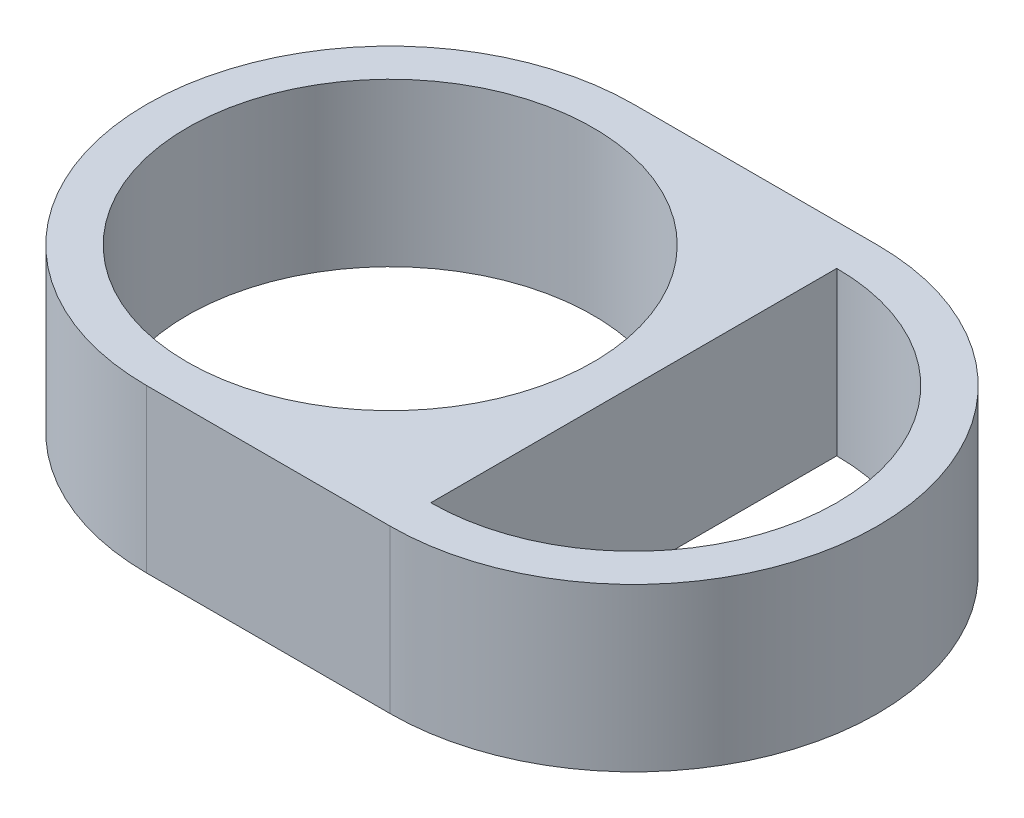
ISO-10303-21;
HEADER;
FILE_DESCRIPTION(('STEP AP214'),'2;1');
FILE_NAME('part.step','',(''),(''),'','','');
FILE_SCHEMA(('AUTOMOTIVE_DESIGN { 1 0 10303 214 1 1 1 1 }'));
ENDSEC;
DATA;
#1=APPLICATION_CONTEXT('core data for automotive mechanical design processes');
#2=APPLICATION_PROTOCOL_DEFINITION('international standard','automotive_design',2000,#1);
#3=PRODUCT_CONTEXT('',#1,'mechanical');
#4=PRODUCT('Part','Part','',(#3));
#5=PRODUCT_RELATED_PRODUCT_CATEGORY('part','',(#4));
#6=PRODUCT_DEFINITION_FORMATION('','',#4);
#7=PRODUCT_DEFINITION_CONTEXT('part definition',#1,'design');
#8=PRODUCT_DEFINITION('design','',#6,#7);
#9=PRODUCT_DEFINITION_SHAPE('','',#8);
#10=(LENGTH_UNIT() NAMED_UNIT(*) SI_UNIT(.MILLI.,.METRE.));
#11=(NAMED_UNIT(*) PLANE_ANGLE_UNIT() SI_UNIT($,.RADIAN.));
#12=(NAMED_UNIT(*) SI_UNIT($,.STERADIAN.) SOLID_ANGLE_UNIT());
#13=UNCERTAINTY_MEASURE_WITH_UNIT(LENGTH_MEASURE(1.E-05),#10,'distance_accuracy_value','');
#14=(GEOMETRIC_REPRESENTATION_CONTEXT(3) GLOBAL_UNCERTAINTY_ASSIGNED_CONTEXT((#13)) GLOBAL_UNIT_ASSIGNED_CONTEXT((#10,
#11,#12)) REPRESENTATION_CONTEXT('',''));
#15=CARTESIAN_POINT('',(0.,0.,0.));
#16=DIRECTION('',(0.,0.,1.));
#17=DIRECTION('',(1.,0.,0.));
#18=AXIS2_PLACEMENT_3D('',#15,#16,#17);
#19=CARTESIAN_POINT('',(12.,8.,0.));
#20=DIRECTION('',(0.,-1.,0.));
#21=DIRECTION('',(0.,0.,-1.));
#22=AXIS2_PLACEMENT_3D('',#19,#20,#21);
#23=PLANE('',#22);
#24=CARTESIAN_POINT('',(0.,8.,0.));
#25=DIRECTION('',(0.,1.,0.));
#26=DIRECTION('',(0.,0.,1.));
#27=AXIS2_PLACEMENT_3D('',#24,#25,#26);
#28=CIRCLE('',#27,10.);
#29=CARTESIAN_POINT('',(0.,8.,10.));
#30=VERTEX_POINT('',#29);
#31=EDGE_CURVE('E138',#30,#30,#28,.T.);
#32=ORIENTED_EDGE('',*,*,#31,.F.);
#33=EDGE_LOOP('',(#32));
#34=FACE_BOUND('',#33,.T.);
#35=CARTESIAN_POINT('',(12.,8.,0.));
#36=DIRECTION('',(0.,-1.,0.));
#37=DIRECTION('',(0.,0.,-1.));
#38=AXIS2_PLACEMENT_3D('',#35,#36,#37);
#39=CIRCLE('',#38,12.);
#40=CARTESIAN_POINT('',(12.,8.,-12.));
#41=VERTEX_POINT('',#40);
#42=CARTESIAN_POINT('',(12.,8.,12.));
#43=VERTEX_POINT('',#42);
#44=EDGE_CURVE('E144',#41,#43,#39,.T.);
#45=ORIENTED_EDGE('',*,*,#44,.F.);
#46=DIRECTION('',(-1.,0.,0.));
#47=VECTOR('',#46,1.);
#48=CARTESIAN_POINT('',(12.,8.,-12.));
#49=LINE('',#48,#47);
#50=CARTESIAN_POINT('',(0.,8.,-12.));
#51=VERTEX_POINT('',#50);
#52=EDGE_CURVE('E152',#41,#51,#49,.T.);
#53=ORIENTED_EDGE('',*,*,#52,.T.);
#54=CARTESIAN_POINT('',(0.,8.,0.));
#55=DIRECTION('',(0.,1.,0.));
#56=DIRECTION('',(0.,0.,1.));
#57=AXIS2_PLACEMENT_3D('',#54,#55,#56);
#58=CIRCLE('',#57,12.);
#59=CARTESIAN_POINT('',(0.,8.,12.));
#60=VERTEX_POINT('',#59);
#61=EDGE_CURVE('E150',#51,#60,#58,.T.);
#62=ORIENTED_EDGE('',*,*,#61,.T.);
#63=DIRECTION('',(1.,0.,0.));
#64=VECTOR('',#63,1.);
#65=CARTESIAN_POINT('',(0.,8.,12.));
#66=LINE('',#65,#64);
#67=EDGE_CURVE('E147',#60,#43,#66,.T.);
#68=ORIENTED_EDGE('',*,*,#67,.T.);
#69=EDGE_LOOP('',(#45,#53,#62,#68));
#70=FACE_BOUND('',#69,.T.);
#71=DIRECTION('',(0.,0.,1.));
#72=VECTOR('',#71,1.);
#73=CARTESIAN_POINT('',(12.,8.,-10.));
#74=LINE('',#73,#72);
#75=CARTESIAN_POINT('',(12.,8.,-10.));
#76=VERTEX_POINT('',#75);
#77=CARTESIAN_POINT('',(12.,8.,10.));
#78=VERTEX_POINT('',#77);
#79=EDGE_CURVE('E123',#76,#78,#74,.T.);
#80=ORIENTED_EDGE('',*,*,#79,.F.);
#81=CARTESIAN_POINT('',(12.,8.,0.));
#82=DIRECTION('',(0.,-1.,0.));
#83=DIRECTION('',(0.,0.,-1.));
#84=AXIS2_PLACEMENT_3D('',#81,#82,#83);
#85=CIRCLE('',#84,10.);
#86=EDGE_CURVE('E126',#76,#78,#85,.T.);
#87=ORIENTED_EDGE('',*,*,#86,.T.);
#88=EDGE_LOOP('',(#80,#87));
#89=FACE_BOUND('',#88,.T.);
#90=ADVANCED_FACE('F68',(#34,#70,#89),#23,.F.);
#91=CARTESIAN_POINT('',(12.,0.,0.));
#92=DIRECTION('',(0.,-1.,0.));
#93=DIRECTION('',(0.,0.,-1.));
#94=AXIS2_PLACEMENT_3D('',#91,#92,#93);
#95=PLANE('',#94);
#96=CARTESIAN_POINT('',(12.,0.,0.));
#97=DIRECTION('',(0.,-1.,0.));
#98=DIRECTION('',(0.,0.,-1.));
#99=AXIS2_PLACEMENT_3D('',#96,#97,#98);
#100=CIRCLE('',#99,12.);
#101=CARTESIAN_POINT('',(12.,0.,-12.));
#102=VERTEX_POINT('',#101);
#103=CARTESIAN_POINT('',(12.,0.,12.));
#104=VERTEX_POINT('',#103);
#105=EDGE_CURVE('E141',#102,#104,#100,.T.);
#106=ORIENTED_EDGE('',*,*,#105,.T.);
#107=DIRECTION('',(1.,0.,0.));
#108=VECTOR('',#107,1.);
#109=CARTESIAN_POINT('',(0.,0.,12.));
#110=LINE('',#109,#108);
#111=CARTESIAN_POINT('',(0.,0.,12.));
#112=VERTEX_POINT('',#111);
#113=EDGE_CURVE('E156',#112,#104,#110,.T.);
#114=ORIENTED_EDGE('',*,*,#113,.F.);
#115=CARTESIAN_POINT('',(0.,0.,0.));
#116=DIRECTION('',(0.,1.,0.));
#117=DIRECTION('',(0.,0.,1.));
#118=AXIS2_PLACEMENT_3D('',#115,#116,#117);
#119=CIRCLE('',#118,12.);
#120=CARTESIAN_POINT('',(0.,0.,-12.));
#121=VERTEX_POINT('',#120);
#122=EDGE_CURVE('E159',#121,#112,#119,.T.);
#123=ORIENTED_EDGE('',*,*,#122,.F.);
#124=DIRECTION('',(-1.,0.,0.));
#125=VECTOR('',#124,1.);
#126=CARTESIAN_POINT('',(12.,0.,-12.));
#127=LINE('',#126,#125);
#128=EDGE_CURVE('E148',#102,#121,#127,.T.);
#129=ORIENTED_EDGE('',*,*,#128,.F.);
#130=EDGE_LOOP('',(#106,#114,#123,#129));
#131=FACE_BOUND('',#130,.T.);
#132=CARTESIAN_POINT('',(0.,0.,0.));
#133=DIRECTION('',(0.,1.,0.));
#134=DIRECTION('',(0.,0.,1.));
#135=AXIS2_PLACEMENT_3D('',#132,#133,#134);
#136=CIRCLE('',#135,10.);
#137=CARTESIAN_POINT('',(0.,0.,10.));
#138=VERTEX_POINT('',#137);
#139=EDGE_CURVE('E137',#138,#138,#136,.T.);
#140=ORIENTED_EDGE('',*,*,#139,.T.);
#141=EDGE_LOOP('',(#140));
#142=FACE_BOUND('',#141,.T.);
#143=CARTESIAN_POINT('',(12.,0.,0.));
#144=DIRECTION('',(0.,-1.,0.));
#145=DIRECTION('',(0.,0.,-1.));
#146=AXIS2_PLACEMENT_3D('',#143,#144,#145);
#147=CIRCLE('',#146,10.);
#148=CARTESIAN_POINT('',(12.,0.,-10.));
#149=VERTEX_POINT('',#148);
#150=CARTESIAN_POINT('',(12.,0.,10.));
#151=VERTEX_POINT('',#150);
#152=EDGE_CURVE('E131',#149,#151,#147,.T.);
#153=ORIENTED_EDGE('',*,*,#152,.F.);
#154=DIRECTION('',(0.,0.,1.));
#155=VECTOR('',#154,1.);
#156=CARTESIAN_POINT('',(12.,0.,-10.));
#157=LINE('',#156,#155);
#158=EDGE_CURVE('E92',#149,#151,#157,.T.);
#159=ORIENTED_EDGE('',*,*,#158,.T.);
#160=EDGE_LOOP('',(#153,#159));
#161=FACE_BOUND('',#160,.T.);
#162=ADVANCED_FACE('F177',(#131,#142,#161),#95,.T.);
#163=CARTESIAN_POINT('',(12.,8.,0.));
#164=DIRECTION('',(0.,-1.,0.));
#165=DIRECTION('',(0.,0.,-1.));
#166=AXIS2_PLACEMENT_3D('',#163,#164,#165);
#167=CYLINDRICAL_SURFACE('',#166,12.);
#168=ORIENTED_EDGE('',*,*,#105,.F.);
#169=DIRECTION('',(0.,-1.,0.));
#170=VECTOR('',#169,1.);
#171=CARTESIAN_POINT('',(12.,8.,-12.));
#172=LINE('',#171,#170);
#173=EDGE_CURVE('E12',#41,#102,#172,.T.);
#174=ORIENTED_EDGE('',*,*,#173,.F.);
#175=ORIENTED_EDGE('',*,*,#44,.T.);
#176=DIRECTION('',(0.,-1.,0.));
#177=VECTOR('',#176,1.);
#178=CARTESIAN_POINT('',(12.,8.,12.));
#179=LINE('',#178,#177);
#180=EDGE_CURVE('E72',#43,#104,#179,.T.);
#181=ORIENTED_EDGE('',*,*,#180,.T.);
#182=EDGE_LOOP('',(#168,#174,#175,#181));
#183=FACE_BOUND('',#182,.T.);
#184=ADVANCED_FACE('F70',(#183),#167,.T.);
#185=CARTESIAN_POINT('',(12.,8.,-12.));
#186=DIRECTION('',(0.,0.,1.));
#187=DIRECTION('',(1.,0.,0.));
#188=AXIS2_PLACEMENT_3D('',#185,#186,#187);
#189=PLANE('',#188);
#190=ORIENTED_EDGE('',*,*,#128,.T.);
#191=DIRECTION('',(0.,-1.,0.));
#192=VECTOR('',#191,1.);
#193=CARTESIAN_POINT('',(0.,8.,-12.));
#194=LINE('',#193,#192);
#195=EDGE_CURVE('E77',#51,#121,#194,.T.);
#196=ORIENTED_EDGE('',*,*,#195,.F.);
#197=ORIENTED_EDGE('',*,*,#52,.F.);
#198=ORIENTED_EDGE('',*,*,#173,.T.);
#199=EDGE_LOOP('',(#190,#196,#197,#198));
#200=FACE_BOUND('',#199,.T.);
#201=ADVANCED_FACE('F181',(#200),#189,.F.);
#202=CARTESIAN_POINT('',(0.,8.,0.));
#203=DIRECTION('',(0.,-1.,0.));
#204=DIRECTION('',(0.,0.,-1.));
#205=AXIS2_PLACEMENT_3D('',#202,#203,#204);
#206=CYLINDRICAL_SURFACE('',#205,12.);
#207=ORIENTED_EDGE('',*,*,#122,.T.);
#208=DIRECTION('',(0.,-1.,0.));
#209=VECTOR('',#208,1.);
#210=CARTESIAN_POINT('',(0.,8.,12.));
#211=LINE('',#210,#209);
#212=EDGE_CURVE('E163',#60,#112,#211,.T.);
#213=ORIENTED_EDGE('',*,*,#212,.F.);
#214=ORIENTED_EDGE('',*,*,#61,.F.);
#215=ORIENTED_EDGE('',*,*,#195,.T.);
#216=EDGE_LOOP('',(#207,#213,#214,#215));
#217=FACE_BOUND('',#216,.T.);
#218=ADVANCED_FACE('F185',(#217),#206,.T.);
#219=CARTESIAN_POINT('',(0.,8.,12.));
#220=DIRECTION('',(0.,0.,-1.));
#221=DIRECTION('',(-1.,0.,0.));
#222=AXIS2_PLACEMENT_3D('',#219,#220,#221);
#223=PLANE('',#222);
#224=ORIENTED_EDGE('',*,*,#113,.T.);
#225=ORIENTED_EDGE('',*,*,#180,.F.);
#226=ORIENTED_EDGE('',*,*,#67,.F.);
#227=ORIENTED_EDGE('',*,*,#212,.T.);
#228=EDGE_LOOP('',(#224,#225,#226,#227));
#229=FACE_BOUND('',#228,.T.);
#230=ADVANCED_FACE('F173',(#229),#223,.F.);
#231=CARTESIAN_POINT('',(0.,8.,0.));
#232=DIRECTION('',(0.,-1.,0.));
#233=DIRECTION('',(0.,0.,-1.));
#234=AXIS2_PLACEMENT_3D('',#231,#232,#233);
#235=CYLINDRICAL_SURFACE('',#234,10.);
#236=ORIENTED_EDGE('',*,*,#31,.T.);
#237=EDGE_LOOP('',(#236));
#238=FACE_BOUND('',#237,.T.);
#239=ORIENTED_EDGE('',*,*,#139,.F.);
#240=EDGE_LOOP('',(#239));
#241=FACE_BOUND('',#240,.T.);
#242=ADVANCED_FACE('F196',(#238,#241),#235,.F.);
#243=CARTESIAN_POINT('',(12.,8.,-10.));
#244=DIRECTION('',(1.,0.,0.));
#245=DIRECTION('',(0.,0.,-1.));
#246=AXIS2_PLACEMENT_3D('',#243,#244,#245);
#247=PLANE('',#246);
#248=ORIENTED_EDGE('',*,*,#158,.F.);
#249=DIRECTION('',(0.,-1.,0.));
#250=VECTOR('',#249,1.);
#251=CARTESIAN_POINT('',(12.,8.,-10.));
#252=LINE('',#251,#250);
#253=EDGE_CURVE('E120',#76,#149,#252,.T.);
#254=ORIENTED_EDGE('',*,*,#253,.F.);
#255=ORIENTED_EDGE('',*,*,#79,.T.);
#256=DIRECTION('',(0.,-1.,0.));
#257=VECTOR('',#256,1.);
#258=CARTESIAN_POINT('',(12.,8.,10.));
#259=LINE('',#258,#257);
#260=EDGE_CURVE('E85',#78,#151,#259,.T.);
#261=ORIENTED_EDGE('',*,*,#260,.T.);
#262=EDGE_LOOP('',(#248,#254,#255,#261));
#263=FACE_BOUND('',#262,.T.);
#264=ADVANCED_FACE('F121',(#263),#247,.T.);
#265=CARTESIAN_POINT('',(12.,8.,0.));
#266=DIRECTION('',(0.,-1.,0.));
#267=DIRECTION('',(0.,0.,-1.));
#268=AXIS2_PLACEMENT_3D('',#265,#266,#267);
#269=CYLINDRICAL_SURFACE('',#268,10.);
#270=ORIENTED_EDGE('',*,*,#152,.T.);
#271=ORIENTED_EDGE('',*,*,#260,.F.);
#272=ORIENTED_EDGE('',*,*,#86,.F.);
#273=ORIENTED_EDGE('',*,*,#253,.T.);
#274=EDGE_LOOP('',(#270,#271,#272,#273));
#275=FACE_BOUND('',#274,.T.);
#276=ADVANCED_FACE('F128',(#275),#269,.F.);
#277=CLOSED_SHELL('',(#90,#162,#184,#201,#218,#230,#242,#264,#276));
#278=MANIFOLD_SOLID_BREP('B2',#277);
#279=ADVANCED_BREP_SHAPE_REPRESENTATION('',(#18,#278),#14);
#280=SHAPE_DEFINITION_REPRESENTATION(#9,#279);
ENDSEC;
END-ISO-10303-21;
